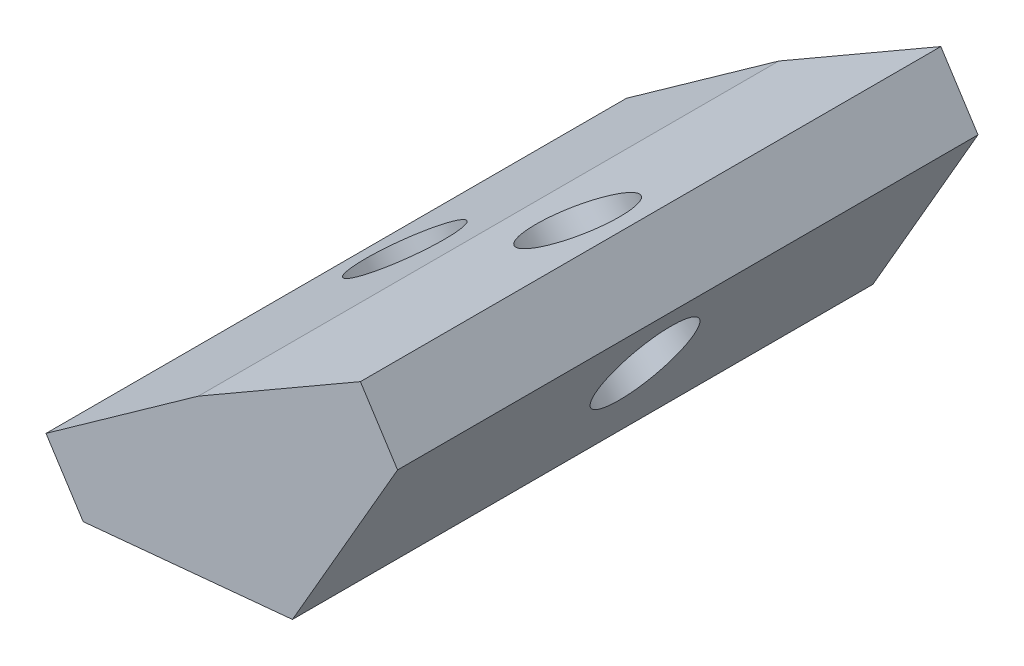
ISO-10303-21;
HEADER;
FILE_DESCRIPTION(('STEP AP214'),'2;1');
FILE_NAME('part.step','',(''),(''),'','','');
FILE_SCHEMA(('AUTOMOTIVE_DESIGN { 1 0 10303 214 1 1 1 1 }'));
ENDSEC;
DATA;
#1=APPLICATION_CONTEXT('core data for automotive mechanical design processes');
#2=APPLICATION_PROTOCOL_DEFINITION('international standard','automotive_design',2000,#1);
#3=PRODUCT_CONTEXT('',#1,'mechanical');
#4=PRODUCT('Part','Part','',(#3));
#5=PRODUCT_RELATED_PRODUCT_CATEGORY('part','',(#4));
#6=PRODUCT_DEFINITION_FORMATION('','',#4);
#7=PRODUCT_DEFINITION_CONTEXT('part definition',#1,'design');
#8=PRODUCT_DEFINITION('design','',#6,#7);
#9=PRODUCT_DEFINITION_SHAPE('','',#8);
#10=(LENGTH_UNIT() NAMED_UNIT(*) SI_UNIT(.MILLI.,.METRE.));
#11=(NAMED_UNIT(*) PLANE_ANGLE_UNIT() SI_UNIT($,.RADIAN.));
#12=(NAMED_UNIT(*) SI_UNIT($,.STERADIAN.) SOLID_ANGLE_UNIT());
#13=UNCERTAINTY_MEASURE_WITH_UNIT(LENGTH_MEASURE(1.E-05),#10,'distance_accuracy_value','');
#14=(GEOMETRIC_REPRESENTATION_CONTEXT(3) GLOBAL_UNCERTAINTY_ASSIGNED_CONTEXT((#13)) GLOBAL_UNIT_ASSIGNED_CONTEXT((#10,
#11,#12)) REPRESENTATION_CONTEXT('',''));
#15=CARTESIAN_POINT('',(0.,0.,0.));
#16=DIRECTION('',(0.,0.,1.));
#17=DIRECTION('',(1.,0.,0.));
#18=AXIS2_PLACEMENT_3D('',#15,#16,#17);
#19=CARTESIAN_POINT('',(-10.4534735725903,-3.99709612578153,7.5));
#20=DIRECTION('',(0.499999999999987,-0.866025403784446,0.));
#21=DIRECTION('',(0.866025403784446,0.499999999999987,0.));
#22=AXIS2_PLACEMENT_3D('',#19,#20,#21);
#23=PLANE('',#22);
#24=DIRECTION('',(-0.866025403784446,-0.499999999999987,0.));
#25=VECTOR('',#24,1.);
#26=CARTESIAN_POINT('',(-10.4534735725903,-3.99709612578153,-7.5));
#27=LINE('',#26,#25);
#28=CARTESIAN_POINT('',(-6.26687172803054,-1.57996042383524,-7.5));
#29=VERTEX_POINT('',#28);
#30=CARTESIAN_POINT('',(-10.4534735725903,-3.99709612578153,-7.5));
#31=VERTEX_POINT('',#30);
#32=EDGE_CURVE('E143',#29,#31,#27,.T.);
#33=ORIENTED_EDGE('',*,*,#32,.T.);
#34=DIRECTION('',(0.,0.,-1.));
#35=VECTOR('',#34,1.);
#36=CARTESIAN_POINT('',(-10.4534735725903,-3.99709612578153,7.5));
#37=LINE('',#36,#35);
#38=CARTESIAN_POINT('',(-10.4534735725903,-3.99709612578153,7.5));
#39=VERTEX_POINT('',#38);
#40=EDGE_CURVE('E140',#39,#31,#37,.T.);
#41=ORIENTED_EDGE('',*,*,#40,.F.);
#42=DIRECTION('',(-0.866025403784446,-0.499999999999987,0.));
#43=VECTOR('',#42,1.);
#44=CARTESIAN_POINT('',(-10.4534735725903,-3.99709612578153,7.5));
#45=LINE('',#44,#43);
#46=CARTESIAN_POINT('',(-6.26687172803054,-1.57996042383524,7.5));
#47=VERTEX_POINT('',#46);
#48=EDGE_CURVE('E85',#47,#39,#45,.T.);
#49=ORIENTED_EDGE('',*,*,#48,.F.);
#50=DIRECTION('',(0.,0.,-1.));
#51=VECTOR('',#50,1.);
#52=CARTESIAN_POINT('',(-6.26687172803054,-1.57996042383524,7.5));
#53=LINE('',#52,#51);
#54=EDGE_CURVE('E52',#47,#29,#53,.T.);
#55=ORIENTED_EDGE('',*,*,#54,.T.);
#56=EDGE_LOOP('',(#33,#41,#49,#55));
#57=FACE_BOUND('',#56,.T.);
#58=CARTESIAN_POINT('',(-9.23531369788991,-3.29379119420727,0.));
#59=CARTESIAN_POINT('',(-9.23531076870734,-3.29378950304292,0.0692361886470834));
#60=CARTESIAN_POINT('',(-9.23031364031875,-3.2909044096226,0.138545057931221));
#61=CARTESIAN_POINT('',(-9.21045600267607,-3.27943959718413,0.27521306493357));
#62=CARTESIAN_POINT('',(-9.19559549338818,-3.27085987814647,0.3425722026451));
#63=CARTESIAN_POINT('',(-9.15642440761237,-3.24824444122935,0.473531987700482));
#64=CARTESIAN_POINT('',(-9.13211383968625,-3.23420872829306,0.53713263844948));
#65=CARTESIAN_POINT('',(-9.07471226587634,-3.201067914202,0.658808053814582));
#66=CARTESIAN_POINT('',(-9.04162127318962,-3.18196282066657,0.716882826735954));
#67=CARTESIAN_POINT('',(-8.96757182441312,-3.13921035148211,0.825908237679281));
#68=CARTESIAN_POINT('',(-8.92661338199205,-3.11556298372472,0.876858888078235));
#69=CARTESIAN_POINT('',(-8.83795868595505,-3.06437817110284,0.970229842287755));
#70=CARTESIAN_POINT('',(-8.79026244434174,-3.03684073316806,1.0126501612938));
#71=CARTESIAN_POINT('',(-8.68944771133437,-2.97863531992798,1.08779073238605));
#72=CARTESIAN_POINT('',(-8.63632922877975,-2.94796734972612,1.12051100028512));
#73=CARTESIAN_POINT('',(-8.52613508925134,-2.88434673360628,1.17534897368633));
#74=CARTESIAN_POINT('',(-8.46905943742359,-2.85139409065936,1.19746669297612));
#75=CARTESIAN_POINT('',(-8.35252516823278,-2.78411299897223,1.23048958816556));
#76=CARTESIAN_POINT('',(-8.29306655284322,-2.74978455137142,1.24139477335091));
#77=CARTESIAN_POINT('',(-8.17340627645263,-2.68069865858601,1.25169184008721));
#78=CARTESIAN_POINT('',(-8.11320461564863,-2.64594121351517,1.251083724691));
#79=CARTESIAN_POINT('',(-7.9937186770079,-2.57695597467657,1.23837097207734));
#80=CARTESIAN_POINT('',(-7.93443439916969,-2.54272818090796,1.22626633487833));
#81=CARTESIAN_POINT('',(-7.81841836571111,-2.47574629276034,1.19089440773885));
#82=CARTESIAN_POINT('',(-7.76168661007651,-2.44299219837311,1.16762711786058));
#83=CARTESIAN_POINT('',(-7.65234035261036,-2.37986110719015,1.11057164027787));
#84=CARTESIAN_POINT('',(-7.59972585074205,-2.34948411037321,1.07678345266737));
#85=CARTESIAN_POINT('',(-7.50006526537814,-2.29194504458576,0.999618115051667));
#86=CARTESIAN_POINT('',(-7.45301918181957,-2.2647829755789,0.956240965154892));
#87=CARTESIAN_POINT('',(-7.36579300575125,-2.21442291934547,0.861094110059531));
#88=CARTESIAN_POINT('',(-7.32561291315603,-2.19122493206956,0.809324404965412));
#89=CARTESIAN_POINT('',(-7.253226913337,-2.14943285558848,0.698820315286275));
#90=CARTESIAN_POINT('',(-7.2210210060157,-2.13083876632704,0.640085930786391));
#91=CARTESIAN_POINT('',(-7.16547163123049,-2.09876731984148,0.517272441444359));
#92=CARTESIAN_POINT('',(-7.14212816367209,-2.08528996256282,0.45319333665919));
#93=CARTESIAN_POINT('',(-7.10494748857245,-2.0638236897854,0.321457768388119));
#94=CARTESIAN_POINT('',(-7.09111028095583,-2.0558347742431,0.253801304930583));
#95=CARTESIAN_POINT('',(-7.07332375856296,-2.04556572075163,0.116777039661745));
#96=CARTESIAN_POINT('',(-7.0693744437439,-2.04328558277774,0.0474092378578527));
#97=CARTESIAN_POINT('',(-7.0714726295175,-2.04449697089894,-0.0911244878476478));
#98=CARTESIAN_POINT('',(-7.07752013010762,-2.04798849699256,-0.160290411749308));
#99=CARTESIAN_POINT('',(-7.0994451557199,-2.0606469164318,-0.296512732870268));
#100=CARTESIAN_POINT('',(-7.11532268077989,-2.06981380979925,-0.363569130081454));
#101=CARTESIAN_POINT('',(-7.15646984973306,-2.09357013887076,-0.493722926474772));
#102=CARTESIAN_POINT('',(-7.18173949369694,-2.10815957461563,-0.556820325627103));
#103=CARTESIAN_POINT('',(-7.2409739548856,-2.1423586067282,-0.677315838702771));
#104=CARTESIAN_POINT('',(-7.27493877220065,-2.16196820314803,-0.734713952566928));
#105=CARTESIAN_POINT('',(-7.35062681266726,-2.20566671368585,-0.842227789555438));
#106=CARTESIAN_POINT('',(-7.3923500359127,-2.22975562785807,-0.892343512591658));
#107=CARTESIAN_POINT('',(-7.48240413156965,-2.28174838422723,-0.983910308998819));
#108=CARTESIAN_POINT('',(-7.53073500406372,-2.30965222647185,-1.0253613822615));
#109=CARTESIAN_POINT('',(-7.63267138798434,-2.36850522516864,-1.09845559441526));
#110=CARTESIAN_POINT('',(-7.68627689947165,-2.39945438165588,-1.13009873319337));
#111=CARTESIAN_POINT('',(-7.79728406185616,-2.46354439674055,-1.18270430384146));
#112=CARTESIAN_POINT('',(-7.8546857127886,-2.49668525535832,-1.20366673561232));
#113=CARTESIAN_POINT('',(-7.97170194454126,-2.56424460826028,-1.23433270899624));
#114=CARTESIAN_POINT('',(-8.03131652537481,-2.59866310255216,-1.24403625054147));
#115=CARTESIAN_POINT('',(-8.15111436664838,-2.66782841845978,-1.25191680082506));
#116=CARTESIAN_POINT('',(-8.21129762708959,-2.70257524007622,-1.25009380953911));
#117=CARTESIAN_POINT('',(-8.33057289122209,-2.77143884593078,-1.23497157528032));
#118=CARTESIAN_POINT('',(-8.3896648949156,-2.80555563017018,-1.22167233233086));
#119=CARTESIAN_POINT('',(-8.50512780904573,-2.87221817472463,-1.18396441560705));
#120=CARTESIAN_POINT('',(-8.56149871949857,-2.90476393504904,-1.15955574189892));
#121=CARTESIAN_POINT('',(-8.66996467217322,-2.96738678202366,-1.10030219223852));
#122=CARTESIAN_POINT('',(-8.72205971443449,-2.99746386869665,-1.06545731638258));
#123=CARTESIAN_POINT('',(-8.82053708218152,-3.05431980347448,-0.986292470027797));
#124=CARTESIAN_POINT('',(-8.86691940773292,-3.08109865161722,-0.941972499637813));
#125=CARTESIAN_POINT('',(-8.95269212292194,-3.13061955182072,-0.84507977200352));
#126=CARTESIAN_POINT('',(-8.99208251264688,-3.1533616039319,-0.792507014862281));
#127=CARTESIAN_POINT('',(-9.06278477337066,-3.19418157319308,-0.680559121169));
#128=CARTESIAN_POINT('',(-9.09409664446739,-3.21225949039961,-0.621183984699409));
#129=CARTESIAN_POINT('',(-9.14777890601448,-3.24325295855453,-0.497267531605402));
#130=CARTESIAN_POINT('',(-9.17014929655804,-3.25616850955673,-0.432726215034841));
#131=CARTESIAN_POINT('',(-9.20330839973219,-3.27531292670041,-0.307871972248821));
#132=CARTESIAN_POINT('',(-9.21513242549898,-3.28213953115977,-0.247925135003481));
#133=CARTESIAN_POINT('',(-9.2271447854468,-3.28907487040925,-0.156434183865501));
#134=CARTESIAN_POINT('',(-9.2301956526328,-3.29083628940035,-0.125361539658754));
#135=CARTESIAN_POINT('',(-9.23428653331006,-3.29319816046059,-0.0628649213699611));
#136=CARTESIAN_POINT('',(-9.2353150280233,-3.29379196216014,-0.0314399542112613));
#137=CARTESIAN_POINT('',(-9.23531369788991,-3.29379119420727,0.));
#138=B_SPLINE_CURVE_WITH_KNOTS('',3,(#58,#59,#60,#61,#62,#63,#64,#65,#66,#67,#68,#69,#70,#71,
#72,#73,#74,#75,#76,#77,#78,#79,#80,#81,#82,#83,#84,#85,#86,#87,#88,#89,#90,#91,#92,#93,#94,#95,
#96,#97,#98,#99,#100,#101,#102,#103,#104,#105,#106,#107,#108,#109,#110,#111,#112,#113,#114,#115,
#116,#117,#118,#119,#120,#121,#122,#123,#124,#125,#126,#127,#128,#129,#130,#131,#132,#133,#134,
#135,#136,#137),.UNSPECIFIED.,.T.,.F.,(4,2,2,2,2,2,2,2,2,2,2,2,2,2,2,2,2,2,2,2,2,2,2,2,2,2,2,2,
2,2,2,2,2,2,2,2,2,2,2,4),(0.,0.207596020700013,0.415192042111619,0.622787875440822,
0.830383396753271,1.03797855739787,1.24557334824022,1.4531678006631,1.6607619831277,
1.86835599367256,2.0759499491721,2.28354390433867,2.49113785834857,2.69873181050489,
2.90632576031376,3.11391970753855,3.32151365222573,3.5291075946998,3.73670153552774,
3.94429547545685,4.15188941533295,4.35948335600763,4.567077298245,4.77467124263796,
4.98226518954326,5.18985913904237,5.39745309093259,5.60504704474922,5.8126409998165,
6.02023495532164,6.22782891040387,6.43542286424874,6.64301681617741,6.85061076572097,
7.05820471267184,7.26579865710652,7.47339259937715,7.65713681886756,7.75087321185814,
7.84514196802134),.UNSPECIFIED.);
#139=CARTESIAN_POINT('',(-9.23531369788991,-3.29379119420727,0.));
#140=VERTEX_POINT('',#139);
#141=EDGE_CURVE('E158',#140,#140,#138,.T.);
#142=ORIENTED_EDGE('',*,*,#141,.F.);
#143=EDGE_LOOP('',(#142));
#144=FACE_BOUND('',#143,.T.);
#145=ADVANCED_FACE('F38',(#57,#144),#23,.F.);
#146=CARTESIAN_POINT('',(-5.30593452675804,-3.07548921601845,7.5));
#147=DIRECTION('',(-0.866025403784439,0.499999999999999,0.));
#148=DIRECTION('',(-0.5,-0.866025403784439,0.));
#149=AXIS2_PLACEMENT_3D('',#146,#147,#148);
#150=PLANE('',#149);
#151=DIRECTION('',(0.499999999999999,0.866025403784439,0.));
#152=VECTOR('',#151,1.);
#153=CARTESIAN_POINT('',(-5.30593452675804,-3.07548921601845,-7.5));
#154=LINE('',#153,#152);
#155=CARTESIAN_POINT('',(-8.02245661280733,-7.78064348893881,-7.5));
#156=VERTEX_POINT('',#155);
#157=CARTESIAN_POINT('',(-5.30593452675804,-3.07548921601845,-7.5));
#158=VERTEX_POINT('',#157);
#159=EDGE_CURVE('E75',#156,#158,#154,.T.);
#160=ORIENTED_EDGE('',*,*,#159,.T.);
#161=DIRECTION('',(0.,0.,-1.));
#162=VECTOR('',#161,1.);
#163=CARTESIAN_POINT('',(-5.30593452675804,-3.07548921601845,7.5));
#164=LINE('',#163,#162);
#165=CARTESIAN_POINT('',(-5.30593452675804,-3.07548921601845,7.5));
#166=VERTEX_POINT('',#165);
#167=EDGE_CURVE('E11',#166,#158,#164,.T.);
#168=ORIENTED_EDGE('',*,*,#167,.F.);
#169=DIRECTION('',(0.499999999999999,0.866025403784439,0.));
#170=VECTOR('',#169,1.);
#171=CARTESIAN_POINT('',(-5.30593452675804,-3.07548921601845,7.5));
#172=LINE('',#171,#170);
#173=CARTESIAN_POINT('',(-8.02245661280733,-7.78064348893881,7.5));
#174=VERTEX_POINT('',#173);
#175=EDGE_CURVE('E145',#174,#166,#172,.T.);
#176=ORIENTED_EDGE('',*,*,#175,.F.);
#177=DIRECTION('',(0.,0.,-1.));
#178=VECTOR('',#177,1.);
#179=CARTESIAN_POINT('',(-8.02245661280733,-7.78064348893881,7.5));
#180=LINE('',#179,#178);
#181=EDGE_CURVE('E123',#174,#156,#180,.T.);
#182=ORIENTED_EDGE('',*,*,#181,.T.);
#183=EDGE_LOOP('',(#160,#168,#176,#182));
#184=FACE_BOUND('',#183,.T.);
#185=CARTESIAN_POINT('',(-7.08573579851721,-6.15819544608104,0.));
#186=CARTESIAN_POINT('',(-7.08573711744928,-6.15819773053838,-0.0326198470825758));
#187=CARTESIAN_POINT('',(-7.08504809299296,-6.15700430517237,-0.0652244703777781));
#188=CARTESIAN_POINT('',(-7.08094482240778,-6.14989723204169,-0.162057027291051));
#189=CARTESIAN_POINT('',(-7.07552311051279,-6.14050655157575,-0.225997779941671));
#190=CARTESIAN_POINT('',(-7.05938852285061,-6.11256062598524,-0.352023686220966));
#191=CARTESIAN_POINT('',(-7.04860467320108,-6.09388245049047,-0.414071765442163));
#192=CARTESIAN_POINT('',(-7.02211397165457,-6.04799920948541,-0.533841834929905));
#193=CARTESIAN_POINT('',(-7.00640672205081,-6.02079345512678,-0.591563475244615));
#194=CARTESIAN_POINT('',(-6.97944648368346,-5.97409695248902,-0.674255112516302));
#195=CARTESIAN_POINT('',(-6.96979954612255,-5.95738796649482,-0.701376663525119));
#196=CARTESIAN_POINT('',(-6.94946449981979,-5.92216663312322,-0.753998890554638));
#197=CARTESIAN_POINT('',(-6.9387767005728,-5.90365482180665,-0.779500044687743));
#198=CARTESIAN_POINT('',(-6.90501789154122,-5.84518284936143,-0.853936245456426));
#199=CARTESIAN_POINT('',(-6.88044906858893,-5.80262839972566,-0.900201579801285));
#200=CARTESIAN_POINT('',(-6.82807650229047,-5.71191645397379,-0.98475031547816));
#201=CARTESIAN_POINT('',(-6.80027046707722,-5.66375498822748,-1.02302800755712));
#202=CARTESIAN_POINT('',(-6.75539431518203,-5.58602721309686,-1.07552096588183));
#203=CARTESIAN_POINT('',(-6.73919080470982,-5.557961909698,-1.09276396162584));
#204=CARTESIAN_POINT('',(-6.70616996547365,-5.50076813843238,-1.12462204268223));
#205=CARTESIAN_POINT('',(-6.68935322268291,-5.47164068550101,-1.13923956150321));
#206=CARTESIAN_POINT('',(-6.63812146181984,-5.38290467272496,-1.17909235579215));
#207=CARTESIAN_POINT('',(-6.6029094348207,-5.32191565292495,-1.20034584219646));
#208=CARTESIAN_POINT('',(-6.53130362444943,-5.19789075124475,-1.23188655891811));
#209=CARTESIAN_POINT('',(-6.49490996381932,-5.13485508195998,-1.24217492450417));
#210=CARTESIAN_POINT('',(-6.42176136657323,-5.00815799502736,-1.25168745743836));
#211=CARTESIAN_POINT('',(-6.38500644400833,-4.94449660171671,-1.25091205341725));
#212=CARTESIAN_POINT('',(-6.31197231275163,-4.81799777569346,-1.2383017672638));
#213=CARTESIAN_POINT('',(-6.27569311655668,-4.75516036462603,-1.22646659519041));
#214=CARTESIAN_POINT('',(-6.20445145981934,-4.63176619554157,-1.19187559397914));
#215=CARTESIAN_POINT('',(-6.16948911952189,-4.57120964579487,-1.16911877015646));
#216=CARTESIAN_POINT('',(-6.10175141634143,-4.45388450229829,-1.11297892123719));
#217=CARTESIAN_POINT('',(-6.06897639337299,-4.3971164972977,-1.07959424917636));
#218=CARTESIAN_POINT('',(-6.00651763091703,-4.28893474734607,-1.00270602814811));
#219=CARTESIAN_POINT('',(-5.97683455776197,-4.23752215651669,-0.959200304542327));
#220=CARTESIAN_POINT('',(-5.92223627834753,-4.142955162565,-0.864163666654566));
#221=CARTESIAN_POINT('',(-5.89721540989105,-4.09961774714886,-0.812876485251558));
#222=CARTESIAN_POINT('',(-5.852663831209,-4.02245214931415,-0.704577993584014));
#223=CARTESIAN_POINT('',(-5.8329681945849,-3.98833830599382,-0.647838474774041));
#224=CARTESIAN_POINT('',(-5.79915117114217,-3.92976550323027,-0.530325414518263));
#225=CARTESIAN_POINT('',(-5.78487705280352,-3.90504200503447,-0.469729478294649));
#226=CARTESIAN_POINT('',(-5.7675689690552,-3.87506352460079,-0.376677807902991));
#227=CARTESIAN_POINT('',(-5.76251935214053,-3.86631733154587,-0.34567331643386));
#228=CARTESIAN_POINT('',(-5.75371822358857,-3.85107332972995,-0.282902961841478));
#229=CARTESIAN_POINT('',(-5.74996797169914,-3.84457770291625,-0.251136391593471));
#230=CARTESIAN_POINT('',(-5.74073270960649,-3.82858175975053,-0.154997896139255));
#231=CARTESIAN_POINT('',(-5.73726630068986,-3.82257776338716,-0.0898038595426447));
#232=CARTESIAN_POINT('',(-5.73588498958079,-3.82018526236521,0.0408061971658088));
#233=CARTESIAN_POINT('',(-5.73796884206647,-3.82379460074586,0.106222164193528));
#234=CARTESIAN_POINT('',(-5.74513857623142,-3.83621294459633,0.202584056040693));
#235=CARTESIAN_POINT('',(-5.7481665409855,-3.84145753339394,0.234189713650756));
#236=CARTESIAN_POINT('',(-5.75551046377258,-3.854177580788,0.296792240006634));
#237=CARTESIAN_POINT('',(-5.75982624163506,-3.86165272731997,0.327789193266647));
#238=CARTESIAN_POINT('',(-5.77477941223505,-3.8875523785335,0.420349947265859));
#239=CARTESIAN_POINT('',(-5.78736364598837,-3.90934891076889,0.480697531292432));
#240=CARTESIAN_POINT('',(-5.81722259418999,-3.9610661261139,0.596564176724243));
#241=CARTESIAN_POINT('',(-5.83449937205445,-3.99099038316515,0.652081099767065));
#242=CARTESIAN_POINT('',(-5.86377610969037,-4.04169918023105,0.731586088696503));
#243=CARTESIAN_POINT('',(-5.87428123769675,-4.05989459567872,0.757825799770392));
#244=CARTESIAN_POINT('',(-5.89629167313788,-4.09801778815994,0.808554146351071));
#245=CARTESIAN_POINT('',(-5.90779664856666,-4.11794499014226,0.833043358237236));
#246=CARTESIAN_POINT('',(-5.94395645472346,-4.18057561159745,0.904239888514632));
#247=CARTESIAN_POINT('',(-5.97004061135033,-4.22575469614789,0.948094152115081));
#248=CARTESIAN_POINT('',(-6.02523597389265,-4.32135586841344,1.02741398916637));
#249=CARTESIAN_POINT('',(-6.05434931918959,-4.37178166164598,1.06287357514088));
#250=CARTESIAN_POINT('',(-6.10111625738319,-4.45278437471173,1.1107982191918));
#251=CARTESIAN_POINT('',(-6.11798398488536,-4.48200013575373,1.12640144968667));
#252=CARTESIAN_POINT('',(-6.15226710281236,-4.54138023784519,1.15487532023653));
#253=CARTESIAN_POINT('',(-6.16968197115008,-4.57154367461324,1.16774847956797));
#254=CARTESIAN_POINT('',(-6.22260649106134,-4.66321163206571,1.20222044229276));
#255=CARTESIAN_POINT('',(-6.2588118526524,-4.72592115784783,1.21968779953036));
#256=CARTESIAN_POINT('',(-6.33210956630707,-4.85287652197636,1.24331852809601));
#257=CARTESIAN_POINT('',(-6.36920184488584,-4.9171222330433,1.24948283266491));
#258=CARTESIAN_POINT('',(-6.44342731241042,-5.04568451401143,1.250454512117));
#259=CARTESIAN_POINT('',(-6.48056050076354,-5.11000108288604,1.24526204942797));
#260=CARTESIAN_POINT('',(-6.55399677759373,-5.23719644547463,1.22357610042942));
#261=CARTESIAN_POINT('',(-6.59029982113021,-5.3000751613492,1.20708200378599));
#262=CARTESIAN_POINT('',(-6.6611927375212,-5.42286529443514,1.16299771896332));
#263=CARTESIAN_POINT('',(-6.69578240076249,-5.48277634858576,1.13540617688087));
#264=CARTESIAN_POINT('',(-6.76233053399239,-5.59804109648884,1.06951551838275));
#265=CARTESIAN_POINT('',(-6.79428850771552,-5.65339393068427,1.03121438838661));
#266=CARTESIAN_POINT('',(-6.85407655135941,-5.75694985996067,0.945331025752053));
#267=CARTESIAN_POINT('',(-6.8819696344399,-5.80526209703585,0.897924930913583));
#268=CARTESIAN_POINT('',(-6.93240820608798,-5.89262426579155,0.796304443824529));
#269=CARTESIAN_POINT('',(-6.95511441931339,-5.93195258074545,0.742410168125345));
#270=CARTESIAN_POINT('',(-6.99498068786223,-6.00100298338021,0.6296778098227));
#271=CARTESIAN_POINT('',(-7.01230278771174,-6.03100574041332,0.571069524259172));
#272=CARTESIAN_POINT('',(-7.04137208185941,-6.08135523481722,0.450523440156542));
#273=CARTESIAN_POINT('',(-7.05325992084606,-6.1019455759343,0.38872214265075));
#274=CARTESIAN_POINT('',(-7.07008171900896,-6.13108178502706,0.273138105888508));
#275=CARTESIAN_POINT('',(-7.07586851272948,-6.14110480576389,0.219844640637857));
#276=CARTESIAN_POINT('',(-7.08373321936776,-6.15472687724801,0.111034869609071));
#277=CARTESIAN_POINT('',(-7.08573355464811,-6.15819155958576,0.0554954033638947));
#278=CARTESIAN_POINT('',(-7.08573579851721,-6.15819544608104,0.));
#279=B_SPLINE_CURVE_WITH_KNOTS('',3,(#185,#186,#187,#188,#189,#190,#191,#192,#193,#194,#195,
#196,#197,#198,#199,#200,#201,#202,#203,#204,#205,#206,#207,#208,#209,#210,#211,#212,#213,#214,
#215,#216,#217,#218,#219,#220,#221,#222,#223,#224,#225,#226,#227,#228,#229,#230,#231,#232,#233,
#234,#235,#236,#237,#238,#239,#240,#241,#242,#243,#244,#245,#246,#247,#248,#249,#250,#251,#252,
#253,#254,#255,#256,#257,#258,#259,#260,#261,#262,#263,#264,#265,#266,#267,#268,#269,#270,#271,
#272,#273,#274,#275,#276,#277,#278),.UNSPECIFIED.,.T.,.F.,(4,2,2,2,2,2,2,2,2,2,2,2,2,2,2,2,2,2,
2,2,2,2,2,2,2,2,2,2,2,2,2,2,2,2,2,2,2,2,2,2,2,2,2,2,2,2,4),(0.,0.0978178493447388,
0.291389638016997,0.487594637261912,0.68381548981461,0.783577992103398,0.883310920573781,
1.08491387404595,1.28666043552605,1.39668292357889,1.50660290145506,1.72633665997805,
1.94604766625719,2.1657501605513,2.38545841469149,2.60518668246601,2.82494901742846,
3.04475861484328,3.25873233607402,3.4650199473808,3.66496673016467,3.76269330107099,
3.86051435550404,4.05620917100807,4.25186008182204,4.34830695683477,4.44474034484214,
4.63996254392666,4.83527072592642,4.93602206507447,5.03674007597284,5.24032444921057,
5.44405359378396,5.55545503456746,5.66675322379171,5.88924445117123,6.11171730765043,
6.33418698227892,6.55666867211606,6.77917751325475,7.00172821791567,7.22034264323351,
7.43079828275013,7.63411296271594,7.83181736459162,7.99492557375783,8.16134085436413),.UNSPECIFIED.);
#280=CARTESIAN_POINT('',(-7.08573579851721,-6.15819544608104,0.));
#281=VERTEX_POINT('',#280);
#282=EDGE_CURVE('E42',#281,#281,#279,.T.);
#283=ORIENTED_EDGE('',*,*,#282,.F.);
#284=EDGE_LOOP('',(#283));
#285=FACE_BOUND('',#284,.T.);
#286=ADVANCED_FACE('F184',(#184,#285),#150,.F.);
#287=CARTESIAN_POINT('',(-10.4534735725903,-3.99709612578153,7.5));
#288=DIRECTION('',(0.579898036804992,-0.814689061488931,0.));
#289=DIRECTION('',(-0.814689061488931,-0.579898036804992,0.));
#290=AXIS2_PLACEMENT_3D('',#287,#288,#289);
#291=PLANE('',#290);
#292=DIRECTION('',(0.814689061488931,0.579898036804992,0.));
#293=VECTOR('',#292,1.);
#294=CARTESIAN_POINT('',(-10.4534735725903,-3.99709612578153,-7.5));
#295=LINE('',#294,#293);
#296=CARTESIAN_POINT('',(-14.3919016056105,-6.80048062228143,-7.5));
#297=VERTEX_POINT('',#296);
#298=EDGE_CURVE('E131',#297,#31,#295,.T.);
#299=ORIENTED_EDGE('',*,*,#298,.F.);
#300=DIRECTION('',(0.,0.,-1.));
#301=VECTOR('',#300,1.);
#302=CARTESIAN_POINT('',(-14.3919016056105,-6.80048062228143,7.5));
#303=LINE('',#302,#301);
#304=CARTESIAN_POINT('',(-14.3919016056105,-6.80048062228143,7.5));
#305=VERTEX_POINT('',#304);
#306=EDGE_CURVE('E114',#305,#297,#303,.T.);
#307=ORIENTED_EDGE('',*,*,#306,.F.);
#308=DIRECTION('',(0.814689061488931,0.579898036804992,0.));
#309=VECTOR('',#308,1.);
#310=CARTESIAN_POINT('',(-10.4534735725903,-3.99709612578153,7.5));
#311=LINE('',#310,#309);
#312=EDGE_CURVE('E110',#305,#39,#311,.T.);
#313=ORIENTED_EDGE('',*,*,#312,.T.);
#314=ORIENTED_EDGE('',*,*,#40,.T.);
#315=EDGE_LOOP('',(#299,#307,#313,#314));
#316=FACE_BOUND('',#315,.T.);
#317=CARTESIAN_POINT('',(-13.6362291660349,-6.2625907881199,0.));
#318=CARTESIAN_POINT('',(-13.6362264104265,-6.26258882666982,0.0692358626818983));
#319=CARTESIAN_POINT('',(-13.6315255168653,-6.259242716999,0.138544405837941));
#320=CARTESIAN_POINT('',(-13.6128450666228,-6.24594591833759,0.275211754098834));
#321=CARTESIAN_POINT('',(-13.5988655112909,-6.23599523030756,0.342570559487253));
#322=CARTESIAN_POINT('',(-13.5620165480782,-6.20976603141993,0.473529755417831));
#323=CARTESIAN_POINT('',(-13.5391471402433,-6.19348752059509,0.537130145979459));
#324=CARTESIAN_POINT('',(-13.4851483839951,-6.15505104928537,0.658805162167831));
#325=CARTESIAN_POINT('',(-13.4540190356421,-6.1328930888435,0.716879787835007));
#326=CARTESIAN_POINT('',(-13.3843592263857,-6.08330903458089,0.825905040356842));
#327=CARTESIAN_POINT('',(-13.3458287655462,-6.05588294080574,0.876855667273141));
#328=CARTESIAN_POINT('',(-13.2624293942321,-5.99651902642173,0.970226708469658));
#329=CARTESIAN_POINT('',(-13.2175604838148,-5.96458120585366,1.01264712282699));
#330=CARTESIAN_POINT('',(-13.1227217718692,-5.89707473563071,1.08778800206827));
#331=CARTESIAN_POINT('',(-13.072751970384,-5.86150608600647,1.12050846703406));
#332=CARTESIAN_POINT('',(-12.9690896960785,-5.78771897850479,1.17534692644398));
#333=CARTESIAN_POINT('',(-12.9153972232838,-5.74950052064567,1.19746492096136));
#334=CARTESIAN_POINT('',(-12.8057705015312,-5.67146790215252,1.23048843042265));
#335=CARTESIAN_POINT('',(-12.7498362525836,-5.63165374152586,1.24139394541841));
#336=CARTESIAN_POINT('',(-12.6372686988412,-5.55152783029309,1.25169171124793));
#337=CARTESIAN_POINT('',(-12.5806353940477,-5.51121607968789,1.2510839621028));
#338=CARTESIAN_POINT('',(-12.4682317287125,-5.43120682469873,1.23837196303158));
#339=CARTESIAN_POINT('',(-12.4124613681718,-5.39150932031548,1.22626771309217));
#340=CARTESIAN_POINT('',(-12.3033217920089,-5.31382345346593,1.19089655368162));
#341=CARTESIAN_POINT('',(-12.2499525763963,-5.2758350910065,1.16762964416557));
#342=CARTESIAN_POINT('',(-12.1470872687663,-5.20261526669591,1.11057488097867));
#343=CARTESIAN_POINT('',(-12.0975911767739,-5.16738380486253,1.07678702723997));
#344=CARTESIAN_POINT('',(-12.003837275756,-5.1006495062042,0.999622268521551));
#345=CARTESIAN_POINT('',(-11.9595794667733,-5.0691466694097,0.956245363463527));
#346=CARTESIAN_POINT('',(-11.8775228193184,-5.01073850976296,0.861098873798062));
#347=CARTESIAN_POINT('',(-11.8397239809042,-4.98383318695205,0.809329289115182));
#348=CARTESIAN_POINT('',(-11.771627820974,-4.93536214281489,0.698825296714455));
#349=CARTESIAN_POINT('',(-11.7413304995242,-4.91379642153578,0.640090888935129));
#350=CARTESIAN_POINT('',(-11.6890730216014,-4.87659939718831,0.517277211959696));
#351=CARTESIAN_POINT('',(-11.6671128651926,-4.86096809416564,0.453197942722441));
#352=CARTESIAN_POINT('',(-11.6321354170023,-4.83607104509896,0.321461933665312));
#353=CARTESIAN_POINT('',(-11.6191181247156,-4.82680529869533,0.253805194047543));
#354=CARTESIAN_POINT('',(-11.602385445981,-4.81489492944234,0.116780330417328));
#355=CARTESIAN_POINT('',(-11.59867005601,-4.81225030408523,0.0474122070530775));
#356=CARTESIAN_POINT('',(-11.6006436487961,-4.81365511315439,-0.0911221816600662));
#357=CARTESIAN_POINT('',(-11.606332631555,-4.81770454758189,-0.160288447008922));
#358=CARTESIAN_POINT('',(-11.626958057436,-4.83238578554379,-0.296511420127752));
#359=CARTESIAN_POINT('',(-11.6418945005324,-4.84301758905989,-0.363568127903587));
#360=CARTESIAN_POINT('',(-11.6806028738472,-4.87057032145095,-0.493722474367882));
#361=CARTESIAN_POINT('',(-11.7043748040174,-4.88749125029172,-0.556820113077863));
#362=CARTESIAN_POINT('',(-11.7600984822804,-4.92715552609434,-0.677316012191564));
#363=CARTESIAN_POINT('',(-11.7920502303118,-4.94989887301253,-0.734714272638019));
#364=CARTESIAN_POINT('',(-11.8632522662141,-5.00058068867451,-0.842228309051993));
#365=CARTESIAN_POINT('',(-11.9025025540211,-5.0285191573729,-0.892344085083154));
#366=CARTESIAN_POINT('',(-11.9872190921749,-5.08882063493359,-0.983910912570463));
#367=CARTESIAN_POINT('',(-12.0326853424656,-5.12118364375597,-1.02536196410479));
#368=CARTESIAN_POINT('',(-12.1285797901051,-5.18944158970776,-1.09845608982841));
#369=CARTESIAN_POINT('',(-12.1790079874126,-5.22533652680778,-1.13009916409928));
#370=CARTESIAN_POINT('',(-12.2834354636492,-5.29966830726334,-1.18270459852467));
#371=CARTESIAN_POINT('',(-12.3374347425545,-5.33810515060184,-1.20366695875076));
#372=CARTESIAN_POINT('',(-12.4475150278171,-5.41646061691688,-1.23433281158422));
#373=CARTESIAN_POINT('',(-12.5035960341654,-5.45637923988697,-1.24403630424057));
#374=CARTESIAN_POINT('',(-12.6162930075403,-5.53659727238948,-1.25191679504582));
#375=CARTESIAN_POINT('',(-12.6729089745661,-5.57689668192132,-1.25009379321226));
#376=CARTESIAN_POINT('',(-12.7851143490531,-5.65676479290967,-1.23497157381145));
#377=CARTESIAN_POINT('',(-12.8407037565128,-5.69633349436512,-1.22167235622731));
#378=CARTESIAN_POINT('',(-12.9493228022669,-5.77364884615994,-1.18396450648423));
#379=CARTESIAN_POINT('',(-13.0023524405502,-5.81139549649147,-1.15955587427748));
#380=CARTESIAN_POINT('',(-13.1043893390183,-5.88402565675805,-1.10030239222839));
#381=CARTESIAN_POINT('',(-13.1533965991764,-5.918909166674,-1.06545754231648));
#382=CARTESIAN_POINT('',(-13.2460370536341,-5.98485091084146,-0.986292697665774));
#383=CARTESIAN_POINT('',(-13.2896702478891,-6.01590914506123,-0.941972702848364));
#384=CARTESIAN_POINT('',(-13.3703591539069,-6.07334374238618,-0.845079848038797));
#385=CARTESIAN_POINT('',(-13.4074148656104,-6.09972010544915,-0.792506987972209));
#386=CARTESIAN_POINT('',(-13.4739265971369,-6.14706334885326,-0.680558797629256));
#387=CARTESIAN_POINT('',(-13.5033826168935,-6.16803022914707,-0.62118346729335));
#388=CARTESIAN_POINT('',(-13.5538831177046,-6.20397663209069,-0.497266542456698));
#389=CARTESIAN_POINT('',(-13.5749275986959,-6.21895615469545,-0.432724947917062));
#390=CARTESIAN_POINT('',(-13.606121153021,-6.24115981713449,-0.307870659100895));
#391=CARTESIAN_POINT('',(-13.6172442450394,-6.24907726629345,-0.247924083108722));
#392=CARTESIAN_POINT('',(-13.6285445082062,-6.25712082638968,-0.156433524947306));
#393=CARTESIAN_POINT('',(-13.6314145193327,-6.25916370863336,-0.125361012415956));
#394=CARTESIAN_POINT('',(-13.6352628918954,-6.26190299138492,-0.0628646576544379));
#395=CARTESIAN_POINT('',(-13.6362304173494,-6.26259167880919,-0.0314398223444047));
#396=CARTESIAN_POINT('',(-13.6362291660349,-6.2625907881199,0.));
#397=B_SPLINE_CURVE_WITH_KNOTS('',3,(#317,#318,#319,#320,#321,#322,#323,#324,#325,#326,#327,
#328,#329,#330,#331,#332,#333,#334,#335,#336,#337,#338,#339,#340,#341,#342,#343,#344,#345,#346,
#347,#348,#349,#350,#351,#352,#353,#354,#355,#356,#357,#358,#359,#360,#361,#362,#363,#364,#365,
#366,#367,#368,#369,#370,#371,#372,#373,#374,#375,#376,#377,#378,#379,#380,#381,#382,#383,#384,
#385,#386,#387,#388,#389,#390,#391,#392,#393,#394,#395,#396),.UNSPECIFIED.,.T.,.F.,(4,2,2,2,2,2,
2,2,2,2,2,2,2,2,2,2,2,2,2,2,2,2,2,2,2,2,2,2,2,2,2,2,2,2,2,2,2,2,2,4),(0.,0.207595043011116,
0.415190055829752,0.622785067573068,0.830380077797415,1.03797508622557,1.24557009277712,
1.45316509757725,1.66076010094304,1.86835510334871,2.07595010537368,2.28354510763908,
2.49114011073969,2.6987351151788,2.90633012131303,3.11392512931329,3.32152013914605,
3.52911515057699,3.73671015028009,3.94430507135665,4.15189999247151,4.35949491300968,
4.56708983241937,4.77468475027241,4.98227966631122,5.18987458047697,5.39746949291605,
5.60506440396404,5.81265931410893,6.02025422393764,6.22784913407175,6.43544404509935,
6.64303895751067,6.85063387164433,7.05822878765023,7.26582370547316,7.47341862485883,
7.65716205990832,7.75089805762194,7.84516641825214),.UNSPECIFIED.);
#398=CARTESIAN_POINT('',(-13.6362291660349,-6.2625907881199,0.));
#399=VERTEX_POINT('',#398);
#400=EDGE_CURVE('E135',#399,#399,#397,.T.);
#401=ORIENTED_EDGE('',*,*,#400,.F.);
#402=EDGE_LOOP('',(#401));
#403=FACE_BOUND('',#402,.T.);
#404=ADVANCED_FACE('F180',(#316,#403),#291,.F.);
#405=CARTESIAN_POINT('',(-13.4310001562108,-8.29603238587242,7.5));
#406=DIRECTION('',(-0.0948619007333653,0.995490441837215,0.));
#407=DIRECTION('',(0.995490441837215,0.0948619007333654,0.));
#408=AXIS2_PLACEMENT_3D('',#405,#406,#407);
#409=PLANE('',#408);
#410=DIRECTION('',(-0.995490441837215,-0.0948619007333654,0.));
#411=VECTOR('',#410,1.);
#412=CARTESIAN_POINT('',(-13.4310001562108,-8.29603238587242,-7.5));
#413=LINE('',#412,#411);
#414=CARTESIAN_POINT('',(-13.4310001562108,-8.29603238587242,-7.5));
#415=VERTEX_POINT('',#414);
#416=EDGE_CURVE('E134',#156,#415,#413,.T.);
#417=ORIENTED_EDGE('',*,*,#416,.F.);
#418=ORIENTED_EDGE('',*,*,#181,.F.);
#419=DIRECTION('',(-0.995490441837215,-0.0948619007333654,0.));
#420=VECTOR('',#419,1.);
#421=CARTESIAN_POINT('',(-13.4310001562108,-8.29603238587242,7.5));
#422=LINE('',#421,#420);
#423=CARTESIAN_POINT('',(-13.4310001562108,-8.29603238587242,7.5));
#424=VERTEX_POINT('',#423);
#425=EDGE_CURVE('E107',#174,#424,#422,.T.);
#426=ORIENTED_EDGE('',*,*,#425,.T.);
#427=DIRECTION('',(0.,0.,-1.));
#428=VECTOR('',#427,1.);
#429=CARTESIAN_POINT('',(-13.4310001562108,-8.29603238587242,7.5));
#430=LINE('',#429,#428);
#431=EDGE_CURVE('E117',#424,#415,#430,.T.);
#432=ORIENTED_EDGE('',*,*,#431,.T.);
#433=EDGE_LOOP('',(#417,#418,#426,#432));
#434=FACE_BOUND('',#433,.T.);
#435=CARTESIAN_POINT('',(-12.5740667590223,-8.21437381091997,0.));
#436=CARTESIAN_POINT('',(-12.5740693839902,-8.21437406105744,-0.0326201723467175));
#437=CARTESIAN_POINT('',(-12.5726975412546,-8.2142433359355,-0.0652251255952701));
#438=CARTESIAN_POINT('',(-12.5645279420371,-8.21346484155979,-0.162058820600251));
#439=CARTESIAN_POINT('',(-12.5537333056749,-8.21243620313185,-0.226000376510898));
#440=CARTESIAN_POINT('',(-12.5216092821352,-8.20937505276425,-0.352027880413025));
#441=CARTESIAN_POINT('',(-12.5001385836678,-8.20732907504233,-0.4140767531308));
#442=CARTESIAN_POINT('',(-12.447395411915,-8.20230309255799,-0.533848330684658));
#443=CARTESIAN_POINT('',(-12.4161221473387,-8.19932301239218,-0.591570685805697));
#444=CARTESIAN_POINT('',(-12.362444128,-8.19420794676482,-0.674263157672974));
#445=CARTESIAN_POINT('',(-12.3432370700432,-8.19237767502331,-0.701384888022087));
#446=CARTESIAN_POINT('',(-12.3027499727081,-8.18851959377361,-0.75400744645823));
#447=CARTESIAN_POINT('',(-12.2814705494461,-8.18649184297615,-0.779508752595873));
#448=CARTESIAN_POINT('',(-12.2142566777455,-8.18008692399606,-0.853945378437257));
#449=CARTESIAN_POINT('',(-12.1653400601773,-8.17542558007469,-0.900210927446134));
#450=CARTESIAN_POINT('',(-12.0610660368701,-8.16548913906808,-0.98475986115556));
#451=CARTESIAN_POINT('',(-12.0057040683855,-8.1602136071914,-1.02303753695064));
#452=CARTESIAN_POINT('',(-11.9163559049036,-8.15169947560488,-1.07552993396085));
#453=CARTESIAN_POINT('',(-11.8840951591096,-8.14862529675145,-1.09277253229499));
#454=CARTESIAN_POINT('',(-11.8183515879383,-8.14236048509661,-1.12462980768854));
#455=CARTESIAN_POINT('',(-11.7848699292174,-8.13916996346778,-1.13924691829637));
#456=CARTESIAN_POINT('',(-11.6828689646113,-8.12945012591583,-1.17909846234493));
#457=CARTESIAN_POINT('',(-11.6127628584563,-8.12276960121828,-1.2003510799704));
#458=CARTESIAN_POINT('',(-11.4701978914231,-8.10918435400506,-1.2318899505025));
#459=CARTESIAN_POINT('',(-11.3977392748661,-8.10227965477115,-1.24217733847812));
#460=CARTESIAN_POINT('',(-11.2521028895801,-8.08840172712509,-1.25168779227566));
#461=CARTESIAN_POINT('',(-11.1789251488132,-8.08142850137748,-1.25091128661168));
#462=CARTESIAN_POINT('',(-11.0335169970836,-8.06757232247762,-1.23829868740147));
#463=CARTESIAN_POINT('',(-10.9612866110101,-8.06068937169711,-1.22646230387456));
#464=CARTESIAN_POINT('',(-10.8194476748166,-8.04717330914157,-1.19186881586605));
#465=CARTESIAN_POINT('',(-10.7498393641113,-8.04054022018076,-1.16911071674636));
#466=CARTESIAN_POINT('',(-10.614977244799,-8.02768898983516,-1.11296833080062));
#467=CARTESIAN_POINT('',(-10.5497241129339,-8.02147091293821,-1.07958239716687));
#468=CARTESIAN_POINT('',(-10.4253728070921,-8.00962127507625,-1.00269177008624));
#469=CARTESIAN_POINT('',(-10.3662759596641,-8.00398984052023,-0.959184902295517));
#470=CARTESIAN_POINT('',(-10.2575752933704,-7.99363157751516,-0.864146341955472));
#471=CARTESIAN_POINT('',(-10.2077610804153,-7.98888470027169,-0.812858395625824));
#472=CARTESIAN_POINT('',(-10.1190631482307,-7.98043253028137,-0.704558369136132));
#473=CARTESIAN_POINT('',(-10.0798511225538,-7.97669595268001,-0.647818017289665));
#474=CARTESIAN_POINT('',(-10.0125251214914,-7.97028034871121,-0.530303246864705));
#475=CARTESIAN_POINT('',(-9.98410711791916,-7.96757235100414,-0.46970638932414));
#476=CARTESIAN_POINT('',(-9.94964929172833,-7.96428880879191,-0.37665339061974));
#477=CARTESIAN_POINT('',(-9.93959632067749,-7.9633308448559,-0.345648382416086));
#478=CARTESIAN_POINT('',(-9.92207492242652,-7.96166120236438,-0.282877055684651));
#479=CARTESIAN_POINT('',(-9.91460900339198,-7.96094976281603,-0.251110030093863));
#480=CARTESIAN_POINT('',(-9.89622405471351,-7.95919783120201,-0.154970025608954));
#481=CARTESIAN_POINT('',(-9.88932410749834,-7.95854032402735,-0.089775027054593));
#482=CARTESIAN_POINT('',(-9.88657727735827,-7.95827857412284,0.040836668158513));
#483=CARTESIAN_POINT('',(-9.89072791528822,-7.95867409515123,0.106253311803796));
#484=CARTESIAN_POINT('',(-9.90500534566218,-7.96003461467601,0.202616026761626));
#485=CARTESIAN_POINT('',(-9.91103484574798,-7.96060917553021,0.234221941592848));
#486=CARTESIAN_POINT('',(-9.92565823092581,-7.96200266165005,0.296824909958499));
#487=CARTESIAN_POINT('',(-9.93425175732568,-7.96282155273533,0.327822048011169));
#488=CARTESIAN_POINT('',(-9.96402596060164,-7.9656587849144,0.420383255441067));
#489=CARTESIAN_POINT('',(-9.98908277936115,-7.96804648986244,0.480730994216417));
#490=CARTESIAN_POINT('',(-10.0485350967076,-7.97371179772462,0.596597634165104));
#491=CARTESIAN_POINT('',(-10.0829347030662,-7.97698979207499,0.652114397078271));
#492=CARTESIAN_POINT('',(-10.1412269145788,-7.98254455156773,0.7316188180633));
#493=CARTESIAN_POINT('',(-10.1621433320044,-7.98453771094911,0.757858248603938));
#494=CARTESIAN_POINT('',(-10.2059674940132,-7.98871378651072,0.808585951653727));
#495=CARTESIAN_POINT('',(-10.2288745776748,-7.99089663971066,0.833074800489641));
#496=CARTESIAN_POINT('',(-10.3008707726319,-7.99775727403952,0.904270120100059));
#497=CARTESIAN_POINT('',(-10.3528056285426,-8.00270623079379,0.948123397779054));
#498=CARTESIAN_POINT('',(-10.4627020562834,-8.01317843984888,1.02744085507049));
#499=CARTESIAN_POINT('',(-10.5206678871218,-8.01870209799752,1.06289904748587));
#500=CARTESIAN_POINT('',(-10.6137819868102,-8.02757509176049,1.11082092225525));
#501=CARTESIAN_POINT('',(-10.6473656407198,-8.03077533267647,1.12642297510906));
#502=CARTESIAN_POINT('',(-10.7156232504019,-8.03727971114342,1.15489444246822));
#503=CARTESIAN_POINT('',(-10.7502961667752,-8.04058374964838,1.16776637632276));
#504=CARTESIAN_POINT('',(-10.8556684880565,-8.05062484925249,1.20223458593728));
#505=CARTESIAN_POINT('',(-10.927752911594,-8.05749389102593,1.21969933692757));
#506=CARTESIAN_POINT('',(-11.0736873606076,-8.07140022164861,1.24332464035399));
#507=CARTESIAN_POINT('',(-11.1475372398552,-8.0784374965635,1.24948612574851));
#508=CARTESIAN_POINT('',(-11.2953180105155,-8.09251976617406,1.25045196894428));
#509=CARTESIAN_POINT('',(-11.369248900756,-8.09956476075801,1.24525648895914));
#510=CARTESIAN_POINT('',(-11.5154574559102,-8.11349721139993,1.22356435695785));
#511=CARTESIAN_POINT('',(-11.5877350313006,-8.12038465892708,1.20706709446573));
#512=CARTESIAN_POINT('',(-11.7288787090816,-8.1338344691795,1.1629764193043));
#513=CARTESIAN_POINT('',(-11.7977443940531,-8.14039679212822,1.13538165268581));
#514=CARTESIAN_POINT('',(-11.9302364761217,-8.15302217777626,1.06948461795689));
#515=CARTESIAN_POINT('',(-11.9938618850842,-8.15908514631463,1.0311803363599));
#516=CARTESIAN_POINT('',(-12.1128925887716,-8.17042777535742,0.945291653339283));
#517=CARTESIAN_POINT('',(-12.1684234626423,-8.17571940250255,0.897883539486916));
#518=CARTESIAN_POINT('',(-12.2688385130541,-8.18528811571561,0.796259386920669));
#519=CARTESIAN_POINT('',(-12.3140426374027,-8.18959569012967,0.742363378321732));
#520=CARTESIAN_POINT('',(-12.3934087993806,-8.19715862058358,0.629627829479482));
#521=CARTESIAN_POINT('',(-12.4278934034367,-8.20044471450204,0.571018016244718));
#522=CARTESIAN_POINT('',(-12.4857632131301,-8.20595922263984,0.450469074132199));
#523=CARTESIAN_POINT('',(-12.5094283732848,-8.20821431417973,0.388666395408636));
#524=CARTESIAN_POINT('',(-12.5429114123401,-8.21140496734288,0.273089652672397));
#525=CARTESIAN_POINT('',(-12.5544285735203,-8.21250245633395,0.219805132463661));
#526=CARTESIAN_POINT('',(-12.5700811843725,-8.21399401903961,0.111014489783262));
#527=CARTESIAN_POINT('',(-12.5740622940873,-8.21437338544906,0.0554852287514766));
#528=CARTESIAN_POINT('',(-12.5740667590223,-8.21437381091997,0.));
#529=B_SPLINE_CURVE_WITH_KNOTS('',3,(#435,#436,#437,#438,#439,#440,#441,#442,#443,#444,#445,
#446,#447,#448,#449,#450,#451,#452,#453,#454,#455,#456,#457,#458,#459,#460,#461,#462,#463,#464,
#465,#466,#467,#468,#469,#470,#471,#472,#473,#474,#475,#476,#477,#478,#479,#480,#481,#482,#483,
#484,#485,#486,#487,#488,#489,#490,#491,#492,#493,#494,#495,#496,#497,#498,#499,#500,#501,#502,
#503,#504,#505,#506,#507,#508,#509,#510,#511,#512,#513,#514,#515,#516,#517,#518,#519,#520,#521,
#522,#523,#524,#525,#526,#527,#528),.UNSPECIFIED.,.T.,.F.,(4,2,2,2,2,2,2,2,2,2,2,2,2,2,2,2,2,2,
2,2,2,2,2,2,2,2,2,2,2,2,2,2,2,2,2,2,2,2,2,2,2,2,2,2,2,2,4),(0.,0.097818833755048,
0.291393046650956,0.487600535216294,0.683823866287172,0.783587136361125,0.883320836731932,
1.08492543222543,1.28667362405951,1.39669519581269,1.50661425699778,1.72634618764488,
1.94605537046668,2.16575604378636,2.38546247763442,2.60518892389436,2.82494943386519,
3.04475720003944,3.25872866545125,3.46501556446708,3.66496292736372,3.76269029972421,
3.86051215611183,4.05620931702909,4.25186257793806,4.34831070897158,4.44474535380137,
4.6399701143617,4.8352808493279,4.93603324036817,5.03675230745502,5.24033889567338,
5.44407024309977,5.55547110507499,5.66676871490133,5.8892587895995,6.11173049939936,
6.33419903161613,6.55667958161892,6.77918728356361,7.00173684715052,7.2203466745388,
7.43079947972517,7.63411295544219,7.8318176297173,7.99489719566115,8.16128198080024),.UNSPECIFIED.);
#530=CARTESIAN_POINT('',(-12.5740667590223,-8.21437381091997,0.));
#531=VERTEX_POINT('',#530);
#532=EDGE_CURVE('E151',#531,#531,#529,.T.);
#533=ORIENTED_EDGE('',*,*,#532,.F.);
#534=EDGE_LOOP('',(#533));
#535=FACE_BOUND('',#534,.T.);
#536=ADVANCED_FACE('F125',(#434,#535),#409,.F.);
#537=CARTESIAN_POINT('',(-6.26687172803054,-1.57996042383524,7.5));
#538=DIRECTION('',(-0.84129978649117,-0.540568838585718,0.));
#539=DIRECTION('',(0.540568838585718,-0.84129978649117,0.));
#540=AXIS2_PLACEMENT_3D('',#537,#538,#539);
#541=PLANE('',#540);
#542=DIRECTION('',(-0.540568838585718,0.84129978649117,0.));
#543=VECTOR('',#542,1.);
#544=CARTESIAN_POINT('',(-6.26687172803054,-1.57996042383524,-7.5));
#545=LINE('',#544,#543);
#546=EDGE_CURVE('E80',#158,#29,#545,.T.);
#547=ORIENTED_EDGE('',*,*,#546,.T.);
#548=ORIENTED_EDGE('',*,*,#54,.F.);
#549=DIRECTION('',(-0.540568838585718,0.84129978649117,0.));
#550=VECTOR('',#549,1.);
#551=CARTESIAN_POINT('',(-6.26687172803054,-1.57996042383524,7.5));
#552=LINE('',#551,#550);
#553=EDGE_CURVE('E61',#166,#47,#552,.T.);
#554=ORIENTED_EDGE('',*,*,#553,.F.);
#555=ORIENTED_EDGE('',*,*,#167,.T.);
#556=EDGE_LOOP('',(#547,#548,#554,#555));
#557=FACE_BOUND('',#556,.T.);
#558=ADVANCED_FACE('F189',(#557),#541,.F.);
#559=CARTESIAN_POINT('',(0.,0.,7.5));
#560=DIRECTION('',(0.,0.,1.));
#561=DIRECTION('',(1.,0.,0.));
#562=AXIS2_PLACEMENT_3D('',#559,#560,#561);
#563=PLANE('',#562);
#564=ORIENTED_EDGE('',*,*,#48,.T.);
#565=ORIENTED_EDGE('',*,*,#312,.F.);
#566=DIRECTION('',(-0.540548726607144,0.841312708904005,0.));
#567=VECTOR('',#566,1.);
#568=CARTESIAN_POINT('',(-14.3919016056105,-6.80048062228143,7.5));
#569=LINE('',#568,#567);
#570=EDGE_CURVE('E103',#424,#305,#569,.T.);
#571=ORIENTED_EDGE('',*,*,#570,.F.);
#572=ORIENTED_EDGE('',*,*,#425,.F.);
#573=ORIENTED_EDGE('',*,*,#175,.T.);
#574=ORIENTED_EDGE('',*,*,#553,.T.);
#575=EDGE_LOOP('',(#564,#565,#571,#572,#573,#574));
#576=FACE_BOUND('',#575,.T.);
#577=ADVANCED_FACE('F105',(#576),#563,.T.);
#578=CARTESIAN_POINT('',(0.,0.,-7.5));
#579=DIRECTION('',(0.,0.,1.));
#580=DIRECTION('',(1.,0.,0.));
#581=AXIS2_PLACEMENT_3D('',#578,#579,#580);
#582=PLANE('',#581);
#583=ORIENTED_EDGE('',*,*,#32,.F.);
#584=ORIENTED_EDGE('',*,*,#546,.F.);
#585=ORIENTED_EDGE('',*,*,#159,.F.);
#586=ORIENTED_EDGE('',*,*,#416,.T.);
#587=DIRECTION('',(-0.540548726607144,0.841312708904005,0.));
#588=VECTOR('',#587,1.);
#589=CARTESIAN_POINT('',(-14.3919016056105,-6.80048062228143,-7.5));
#590=LINE('',#589,#588);
#591=EDGE_CURVE('E119',#415,#297,#590,.T.);
#592=ORIENTED_EDGE('',*,*,#591,.T.);
#593=ORIENTED_EDGE('',*,*,#298,.T.);
#594=EDGE_LOOP('',(#583,#584,#585,#586,#592,#593));
#595=FACE_BOUND('',#594,.T.);
#596=ADVANCED_FACE('F188',(#595),#582,.F.);
#597=CARTESIAN_POINT('',(-14.3919016056105,-6.80048062228143,7.5));
#598=DIRECTION('',(0.841312708904005,0.540548726607144,0.));
#599=DIRECTION('',(0.540548726607144,-0.841312708904005,0.));
#600=AXIS2_PLACEMENT_3D('',#597,#598,#599);
#601=PLANE('',#600);
#602=ORIENTED_EDGE('',*,*,#591,.F.);
#603=ORIENTED_EDGE('',*,*,#431,.F.);
#604=ORIENTED_EDGE('',*,*,#570,.T.);
#605=ORIENTED_EDGE('',*,*,#306,.T.);
#606=EDGE_LOOP('',(#602,#603,#604,#605));
#607=FACE_BOUND('',#606,.T.);
#608=ADVANCED_FACE('F118',(#607),#601,.F.);
#609=CARTESIAN_POINT('',(-16.2385227423801,1.11544509011356,0.));
#610=DIRECTION('',(-0.579880408145867,0.814701609332265,0.));
#611=DIRECTION('',(-0.814701609332265,-0.579880408145867,0.));
#612=AXIS2_PLACEMENT_3D('',#609,#610,#611);
#613=CIRCLE('',#612,1.25000000000001);
#614=DIRECTION('',(0.478003364609929,-0.878358004131338,0.));
#615=VECTOR('',#614,1.);
#616=SURFACE_OF_LINEAR_EXTRUSION('',#613,#615);
#617=ORIENTED_EDGE('',*,*,#532,.T.);
#618=EDGE_LOOP('',(#617));
#619=FACE_BOUND('',#618,.T.);
#620=ORIENTED_EDGE('',*,*,#400,.T.);
#621=EDGE_LOOP('',(#620));
#622=FACE_BOUND('',#621,.T.);
#623=ADVANCED_FACE('F162',(#619,#622),#616,.T.);
#624=CARTESIAN_POINT('',(-12.6992051175835,3.38950415243083,0.));
#625=DIRECTION('',(-0.499974047046107,0.866040387210861,0.));
#626=DIRECTION('',(-0.866040387210861,-0.499974047046107,0.));
#627=AXIS2_PLACEMENT_3D('',#624,#625,#626);
#628=CIRCLE('',#627,1.25);
#629=DIRECTION('',(0.600227776045941,-0.799829117288776,0.));
#630=VECTOR('',#629,1.);
#631=SURFACE_OF_LINEAR_EXTRUSION('',#628,#630);
#632=ORIENTED_EDGE('',*,*,#282,.T.);
#633=EDGE_LOOP('',(#632));
#634=FACE_BOUND('',#633,.T.);
#635=ORIENTED_EDGE('',*,*,#141,.T.);
#636=EDGE_LOOP('',(#635));
#637=FACE_BOUND('',#636,.T.);
#638=ADVANCED_FACE('F166',(#634,#637),#631,.T.);
#639=CLOSED_SHELL('',(#145,#286,#404,#536,#558,#577,#596,#608,#623,#638));
#640=MANIFOLD_SOLID_BREP('B2',#639);
#641=ADVANCED_BREP_SHAPE_REPRESENTATION('',(#18,#640),#14);
#642=SHAPE_DEFINITION_REPRESENTATION(#9,#641);
ENDSEC;
END-ISO-10303-21;
